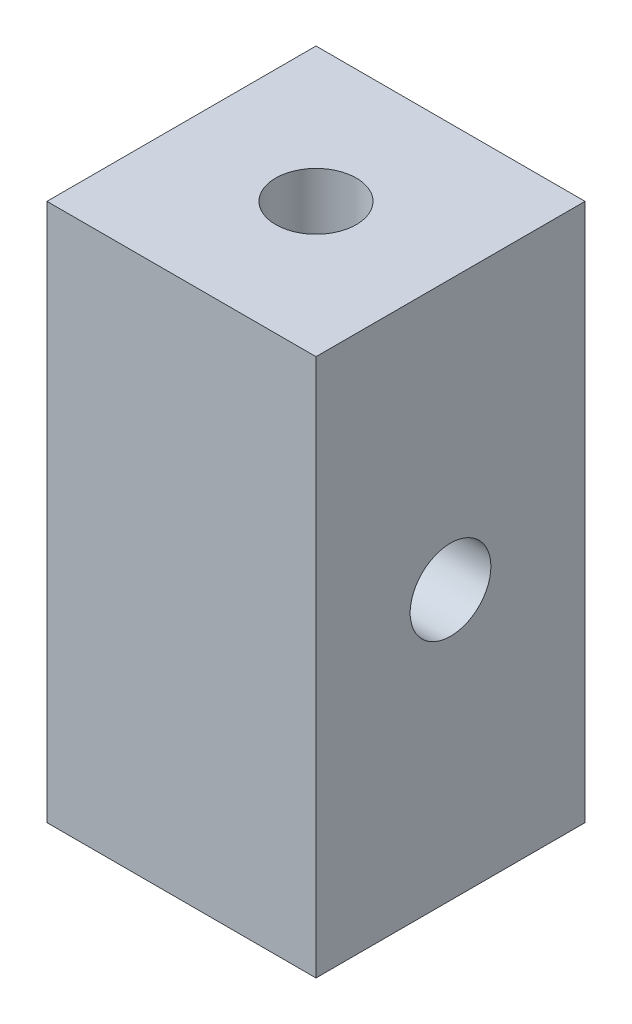
ISO-10303-21;
HEADER;
FILE_DESCRIPTION(('STEP AP214'),'2;1');
FILE_NAME('part.step','',(''),(''),'','','');
FILE_SCHEMA(('AUTOMOTIVE_DESIGN { 1 0 10303 214 1 1 1 1 }'));
ENDSEC;
DATA;
#1=APPLICATION_CONTEXT('core data for automotive mechanical design processes');
#2=APPLICATION_PROTOCOL_DEFINITION('international standard','automotive_design',2000,#1);
#3=PRODUCT_CONTEXT('',#1,'mechanical');
#4=PRODUCT('Part','Part','',(#3));
#5=PRODUCT_RELATED_PRODUCT_CATEGORY('part','',(#4));
#6=PRODUCT_DEFINITION_FORMATION('','',#4);
#7=PRODUCT_DEFINITION_CONTEXT('part definition',#1,'design');
#8=PRODUCT_DEFINITION('design','',#6,#7);
#9=PRODUCT_DEFINITION_SHAPE('','',#8);
#10=(LENGTH_UNIT() NAMED_UNIT(*) SI_UNIT(.MILLI.,.METRE.));
#11=(NAMED_UNIT(*) PLANE_ANGLE_UNIT() SI_UNIT($,.RADIAN.));
#12=(NAMED_UNIT(*) SI_UNIT($,.STERADIAN.) SOLID_ANGLE_UNIT());
#13=UNCERTAINTY_MEASURE_WITH_UNIT(LENGTH_MEASURE(1.E-05),#10,'distance_accuracy_value','');
#14=(GEOMETRIC_REPRESENTATION_CONTEXT(3) GLOBAL_UNCERTAINTY_ASSIGNED_CONTEXT((#13)) GLOBAL_UNIT_ASSIGNED_CONTEXT((#10,
#11,#12)) REPRESENTATION_CONTEXT('',''));
#15=CARTESIAN_POINT('',(0.,0.,0.));
#16=DIRECTION('',(0.,0.,1.));
#17=DIRECTION('',(1.,0.,0.));
#18=AXIS2_PLACEMENT_3D('',#15,#16,#17);
#19=CARTESIAN_POINT('',(-5.,10.,0.));
#20=DIRECTION('',(1.,0.,0.));
#21=DIRECTION('',(0.,0.,-1.));
#22=AXIS2_PLACEMENT_3D('',#19,#20,#21);
#23=CYLINDRICAL_SURFACE('',#22,1.5);
#24=CARTESIAN_POINT('',(5.,10.,0.));
#25=DIRECTION('',(1.,0.,0.));
#26=DIRECTION('',(0.,0.,-1.));
#27=AXIS2_PLACEMENT_3D('',#24,#25,#26);
#28=CIRCLE('',#27,1.5);
#29=CARTESIAN_POINT('',(5.,10.,-1.5));
#30=VERTEX_POINT('',#29);
#31=EDGE_CURVE('E126',#30,#30,#28,.T.);
#32=ORIENTED_EDGE('',*,*,#31,.T.);
#33=EDGE_LOOP('',(#32));
#34=FACE_BOUND('',#33,.T.);
#35=CARTESIAN_POINT('',(0.,10.,0.));
#36=DIRECTION('',(0.707106781186547,-0.707106781186547,0.));
#37=DIRECTION('',(0.707106781186547,0.707106781186547,0.));
#38=AXIS2_PLACEMENT_3D('',#35,#36,#37);
#39=ELLIPSE('',#38,2.12132034355964,1.5);
#40=CARTESIAN_POINT('',(0.,10.,1.5));
#41=VERTEX_POINT('',#40);
#42=CARTESIAN_POINT('',(0.,10.,-1.5));
#43=VERTEX_POINT('',#42);
#44=EDGE_CURVE('E45',#41,#43,#39,.F.);
#45=ORIENTED_EDGE('',*,*,#44,.T.);
#46=CARTESIAN_POINT('',(0.,10.,0.));
#47=DIRECTION('',(0.707106781186547,0.707106781186547,0.));
#48=DIRECTION('',(0.707106781186547,-0.707106781186547,0.));
#49=AXIS2_PLACEMENT_3D('',#46,#47,#48);
#50=ELLIPSE('',#49,2.12132034355964,1.5);
#51=EDGE_CURVE('E11',#43,#41,#50,.F.);
#52=ORIENTED_EDGE('',*,*,#51,.T.);
#53=EDGE_LOOP('',(#45,#52));
#54=FACE_BOUND('',#53,.T.);
#55=ADVANCED_FACE('F32',(#34,#54),#23,.F.);
#56=CARTESIAN_POINT('',(-5.,20.,5.));
#57=DIRECTION('',(0.,0.,-1.));
#58=DIRECTION('',(-1.,0.,0.));
#59=AXIS2_PLACEMENT_3D('',#56,#57,#58);
#60=PLANE('',#59);
#61=DIRECTION('',(1.,0.,0.));
#62=VECTOR('',#61,1.);
#63=CARTESIAN_POINT('',(-5.,0.,5.));
#64=LINE('',#63,#62);
#65=CARTESIAN_POINT('',(-5.,0.,5.));
#66=VERTEX_POINT('',#65);
#67=CARTESIAN_POINT('',(5.,0.,5.));
#68=VERTEX_POINT('',#67);
#69=EDGE_CURVE('E117',#66,#68,#64,.T.);
#70=ORIENTED_EDGE('',*,*,#69,.T.);
#71=DIRECTION('',(0.,-1.,0.));
#72=VECTOR('',#71,1.);
#73=CARTESIAN_POINT('',(5.,20.,5.));
#74=LINE('',#73,#72);
#75=CARTESIAN_POINT('',(5.,20.,5.));
#76=VERTEX_POINT('',#75);
#77=EDGE_CURVE('E95',#76,#68,#74,.T.);
#78=ORIENTED_EDGE('',*,*,#77,.F.);
#79=DIRECTION('',(1.,0.,0.));
#80=VECTOR('',#79,1.);
#81=CARTESIAN_POINT('',(-5.,20.,5.));
#82=LINE('',#81,#80);
#83=CARTESIAN_POINT('',(-5.,20.,5.));
#84=VERTEX_POINT('',#83);
#85=EDGE_CURVE('E110',#84,#76,#82,.T.);
#86=ORIENTED_EDGE('',*,*,#85,.F.);
#87=DIRECTION('',(0.,-1.,0.));
#88=VECTOR('',#87,1.);
#89=CARTESIAN_POINT('',(-5.,20.,5.));
#90=LINE('',#89,#88);
#91=EDGE_CURVE('E54',#84,#66,#90,.T.);
#92=ORIENTED_EDGE('',*,*,#91,.T.);
#93=EDGE_LOOP('',(#70,#78,#86,#92));
#94=FACE_BOUND('',#93,.T.);
#95=ADVANCED_FACE('F34',(#94),#60,.F.);
#96=CARTESIAN_POINT('',(5.,20.,5.));
#97=DIRECTION('',(-1.,0.,0.));
#98=DIRECTION('',(0.,0.,1.));
#99=AXIS2_PLACEMENT_3D('',#96,#97,#98);
#100=PLANE('',#99);
#101=ORIENTED_EDGE('',*,*,#31,.F.);
#102=EDGE_LOOP('',(#101));
#103=FACE_BOUND('',#102,.T.);
#104=DIRECTION('',(0.,0.,-1.));
#105=VECTOR('',#104,1.);
#106=CARTESIAN_POINT('',(5.,0.,5.));
#107=LINE('',#106,#105);
#108=CARTESIAN_POINT('',(5.,0.,-5.));
#109=VERTEX_POINT('',#108);
#110=EDGE_CURVE('E114',#68,#109,#107,.T.);
#111=ORIENTED_EDGE('',*,*,#110,.T.);
#112=DIRECTION('',(0.,-1.,0.));
#113=VECTOR('',#112,1.);
#114=CARTESIAN_POINT('',(5.,20.,-5.));
#115=LINE('',#114,#113);
#116=CARTESIAN_POINT('',(5.,20.,-5.));
#117=VERTEX_POINT('',#116);
#118=EDGE_CURVE('E101',#117,#109,#115,.T.);
#119=ORIENTED_EDGE('',*,*,#118,.F.);
#120=DIRECTION('',(0.,0.,-1.));
#121=VECTOR('',#120,1.);
#122=CARTESIAN_POINT('',(5.,20.,5.));
#123=LINE('',#122,#121);
#124=EDGE_CURVE('E81',#76,#117,#123,.T.);
#125=ORIENTED_EDGE('',*,*,#124,.F.);
#126=ORIENTED_EDGE('',*,*,#77,.T.);
#127=EDGE_LOOP('',(#111,#119,#125,#126));
#128=FACE_BOUND('',#127,.T.);
#129=ADVANCED_FACE('F155',(#103,#128),#100,.F.);
#130=CARTESIAN_POINT('',(-5.,20.,-5.));
#131=DIRECTION('',(0.,0.,-1.));
#132=DIRECTION('',(-1.,0.,0.));
#133=AXIS2_PLACEMENT_3D('',#130,#131,#132);
#134=PLANE('',#133);
#135=DIRECTION('',(1.,0.,0.));
#136=VECTOR('',#135,1.);
#137=CARTESIAN_POINT('',(-5.,0.,-5.));
#138=LINE('',#137,#136);
#139=CARTESIAN_POINT('',(-5.,0.,-5.));
#140=VERTEX_POINT('',#139);
#141=EDGE_CURVE('E111',#140,#109,#138,.T.);
#142=ORIENTED_EDGE('',*,*,#141,.F.);
#143=DIRECTION('',(0.,-1.,0.));
#144=VECTOR('',#143,1.);
#145=CARTESIAN_POINT('',(-5.,20.,-5.));
#146=LINE('',#145,#144);
#147=CARTESIAN_POINT('',(-5.,20.,-5.));
#148=VERTEX_POINT('',#147);
#149=EDGE_CURVE('E103',#148,#140,#146,.T.);
#150=ORIENTED_EDGE('',*,*,#149,.F.);
#151=DIRECTION('',(1.,0.,0.));
#152=VECTOR('',#151,1.);
#153=CARTESIAN_POINT('',(-5.,20.,-5.));
#154=LINE('',#153,#152);
#155=EDGE_CURVE('E121',#148,#117,#154,.T.);
#156=ORIENTED_EDGE('',*,*,#155,.T.);
#157=ORIENTED_EDGE('',*,*,#118,.T.);
#158=EDGE_LOOP('',(#142,#150,#156,#157));
#159=FACE_BOUND('',#158,.T.);
#160=ADVANCED_FACE('F171',(#159),#134,.T.);
#161=CARTESIAN_POINT('',(-5.,20.,5.));
#162=DIRECTION('',(-1.,0.,0.));
#163=DIRECTION('',(0.,0.,1.));
#164=AXIS2_PLACEMENT_3D('',#161,#162,#163);
#165=PLANE('',#164);
#166=CARTESIAN_POINT('',(-5.,10.,0.));
#167=DIRECTION('',(1.,0.,0.));
#168=DIRECTION('',(0.,0.,-1.));
#169=AXIS2_PLACEMENT_3D('',#166,#167,#168);
#170=CIRCLE('',#169,1.5);
#171=CARTESIAN_POINT('',(-5.,10.,-1.5));
#172=VERTEX_POINT('',#171);
#173=EDGE_CURVE('E119',#172,#172,#170,.T.);
#174=ORIENTED_EDGE('',*,*,#173,.T.);
#175=EDGE_LOOP('',(#174));
#176=FACE_BOUND('',#175,.T.);
#177=DIRECTION('',(0.,0.,-1.));
#178=VECTOR('',#177,1.);
#179=CARTESIAN_POINT('',(-5.,0.,5.));
#180=LINE('',#179,#178);
#181=EDGE_CURVE('E107',#66,#140,#180,.T.);
#182=ORIENTED_EDGE('',*,*,#181,.F.);
#183=ORIENTED_EDGE('',*,*,#91,.F.);
#184=DIRECTION('',(0.,0.,-1.));
#185=VECTOR('',#184,1.);
#186=CARTESIAN_POINT('',(-5.,20.,5.));
#187=LINE('',#186,#185);
#188=EDGE_CURVE('E106',#84,#148,#187,.T.);
#189=ORIENTED_EDGE('',*,*,#188,.T.);
#190=ORIENTED_EDGE('',*,*,#149,.T.);
#191=EDGE_LOOP('',(#182,#183,#189,#190));
#192=FACE_BOUND('',#191,.T.);
#193=ADVANCED_FACE('F166',(#176,#192),#165,.T.);
#194=CARTESIAN_POINT('',(0.,20.,0.));
#195=DIRECTION('',(0.,1.,0.));
#196=DIRECTION('',(0.,0.,1.));
#197=AXIS2_PLACEMENT_3D('',#194,#195,#196);
#198=PLANE('',#197);
#199=CARTESIAN_POINT('',(0.,20.,0.));
#200=DIRECTION('',(0.,1.,0.));
#201=DIRECTION('',(0.,0.,1.));
#202=AXIS2_PLACEMENT_3D('',#199,#200,#201);
#203=CIRCLE('',#202,1.5);
#204=CARTESIAN_POINT('',(0.,20.,1.5));
#205=VERTEX_POINT('',#204);
#206=EDGE_CURVE('E132',#205,#205,#203,.T.);
#207=ORIENTED_EDGE('',*,*,#206,.F.);
#208=EDGE_LOOP('',(#207));
#209=FACE_BOUND('',#208,.T.);
#210=ORIENTED_EDGE('',*,*,#85,.T.);
#211=ORIENTED_EDGE('',*,*,#124,.T.);
#212=ORIENTED_EDGE('',*,*,#155,.F.);
#213=ORIENTED_EDGE('',*,*,#188,.F.);
#214=EDGE_LOOP('',(#210,#211,#212,#213));
#215=FACE_BOUND('',#214,.T.);
#216=ADVANCED_FACE('F162',(#209,#215),#198,.T.);
#217=CARTESIAN_POINT('',(0.,0.,0.));
#218=DIRECTION('',(0.,1.,0.));
#219=DIRECTION('',(0.,0.,1.));
#220=AXIS2_PLACEMENT_3D('',#217,#218,#219);
#221=PLANE('',#220);
#222=CARTESIAN_POINT('',(0.,0.,0.));
#223=DIRECTION('',(0.,1.,0.));
#224=DIRECTION('',(0.,0.,1.));
#225=AXIS2_PLACEMENT_3D('',#222,#223,#224);
#226=CIRCLE('',#225,1.5);
#227=CARTESIAN_POINT('',(0.,0.,1.5));
#228=VERTEX_POINT('',#227);
#229=EDGE_CURVE('E129',#228,#228,#226,.T.);
#230=ORIENTED_EDGE('',*,*,#229,.T.);
#231=EDGE_LOOP('',(#230));
#232=FACE_BOUND('',#231,.T.);
#233=ORIENTED_EDGE('',*,*,#69,.F.);
#234=ORIENTED_EDGE('',*,*,#181,.T.);
#235=ORIENTED_EDGE('',*,*,#141,.T.);
#236=ORIENTED_EDGE('',*,*,#110,.F.);
#237=EDGE_LOOP('',(#233,#234,#235,#236));
#238=FACE_BOUND('',#237,.T.);
#239=ADVANCED_FACE('F138',(#232,#238),#221,.F.);
#240=CARTESIAN_POINT('',(0.,10.,0.));
#241=DIRECTION('',(0.707106781186547,-0.707106781186547,0.));
#242=DIRECTION('',(0.707106781186547,0.707106781186547,0.));
#243=AXIS2_PLACEMENT_3D('',#240,#241,#242);
#244=ELLIPSE('',#243,2.12132034355964,1.5);
#245=EDGE_CURVE('E88',#41,#43,#244,.T.);
#246=ORIENTED_EDGE('',*,*,#245,.T.);
#247=CARTESIAN_POINT('',(0.,10.,0.));
#248=DIRECTION('',(0.707106781186547,0.707106781186547,0.));
#249=DIRECTION('',(0.707106781186547,-0.707106781186547,0.));
#250=AXIS2_PLACEMENT_3D('',#247,#248,#249);
#251=ELLIPSE('',#250,2.12132034355964,1.5);
#252=EDGE_CURVE('E40',#43,#41,#251,.T.);
#253=ORIENTED_EDGE('',*,*,#252,.T.);
#254=EDGE_LOOP('',(#246,#253));
#255=FACE_BOUND('',#254,.T.);
#256=ORIENTED_EDGE('',*,*,#173,.F.);
#257=EDGE_LOOP('',(#256));
#258=FACE_BOUND('',#257,.T.);
#259=ADVANCED_FACE('F97',(#255,#258),#23,.F.);
#260=CARTESIAN_POINT('',(0.,0.,0.));
#261=DIRECTION('',(0.,1.,0.));
#262=DIRECTION('',(0.,0.,1.));
#263=AXIS2_PLACEMENT_3D('',#260,#261,#262);
#264=CYLINDRICAL_SURFACE('',#263,1.5);
#265=ORIENTED_EDGE('',*,*,#206,.T.);
#266=EDGE_LOOP('',(#265));
#267=FACE_BOUND('',#266,.T.);
#268=ORIENTED_EDGE('',*,*,#44,.F.);
#269=ORIENTED_EDGE('',*,*,#252,.F.);
#270=EDGE_LOOP('',(#268,#269));
#271=FACE_BOUND('',#270,.T.);
#272=ADVANCED_FACE('F94',(#267,#271),#264,.F.);
#273=ORIENTED_EDGE('',*,*,#229,.F.);
#274=EDGE_LOOP('',(#273));
#275=FACE_BOUND('',#274,.T.);
#276=ORIENTED_EDGE('',*,*,#245,.F.);
#277=ORIENTED_EDGE('',*,*,#51,.F.);
#278=EDGE_LOOP('',(#276,#277));
#279=FACE_BOUND('',#278,.T.);
#280=ADVANCED_FACE('F89',(#275,#279),#264,.F.);
#281=CLOSED_SHELL('',(#55,#95,#129,#160,#193,#216,#239,#259,#272,#280));
#282=MANIFOLD_SOLID_BREP('B2',#281);
#283=ADVANCED_BREP_SHAPE_REPRESENTATION('',(#18,#282),#14);
#284=SHAPE_DEFINITION_REPRESENTATION(#9,#283);
ENDSEC;
END-ISO-10303-21;
